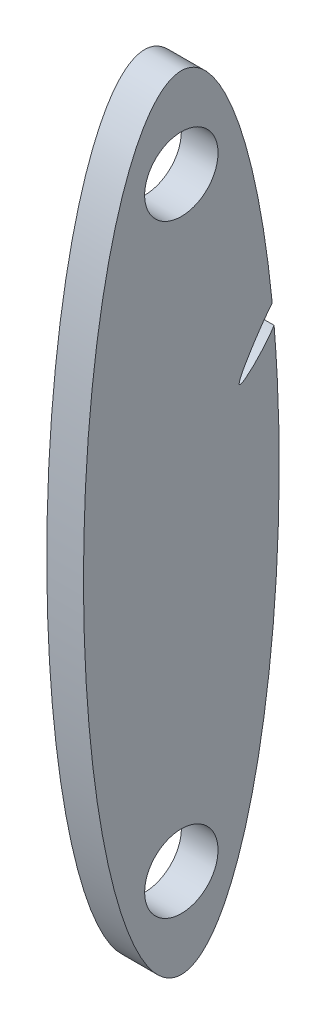
ISO-10303-21;
HEADER;
FILE_DESCRIPTION(('STEP AP214'),'2;1');
FILE_NAME('part.step','',(''),(''),'','','');
FILE_SCHEMA(('AUTOMOTIVE_DESIGN { 1 0 10303 214 1 1 1 1 }'));
ENDSEC;
DATA;
#1=APPLICATION_CONTEXT('core data for automotive mechanical design processes');
#2=APPLICATION_PROTOCOL_DEFINITION('international standard','automotive_design',2000,#1);
#3=PRODUCT_CONTEXT('',#1,'mechanical');
#4=PRODUCT('Part','Part','',(#3));
#5=PRODUCT_RELATED_PRODUCT_CATEGORY('part','',(#4));
#6=PRODUCT_DEFINITION_FORMATION('','',#4);
#7=PRODUCT_DEFINITION_CONTEXT('part definition',#1,'design');
#8=PRODUCT_DEFINITION('design','',#6,#7);
#9=PRODUCT_DEFINITION_SHAPE('','',#8);
#10=(LENGTH_UNIT() NAMED_UNIT(*) SI_UNIT(.MILLI.,.METRE.));
#11=(NAMED_UNIT(*) PLANE_ANGLE_UNIT() SI_UNIT($,.RADIAN.));
#12=(NAMED_UNIT(*) SI_UNIT($,.STERADIAN.) SOLID_ANGLE_UNIT());
#13=UNCERTAINTY_MEASURE_WITH_UNIT(LENGTH_MEASURE(1.E-05),#10,'distance_accuracy_value','');
#14=(GEOMETRIC_REPRESENTATION_CONTEXT(3) GLOBAL_UNCERTAINTY_ASSIGNED_CONTEXT((#13)) GLOBAL_UNIT_ASSIGNED_CONTEXT((#10,
#11,#12)) REPRESENTATION_CONTEXT('',''));
#15=CARTESIAN_POINT('',(0.,0.,0.));
#16=DIRECTION('',(0.,0.,1.));
#17=DIRECTION('',(1.,0.,0.));
#18=AXIS2_PLACEMENT_3D('',#15,#16,#17);
#19=CARTESIAN_POINT('',(-33.4763085519601,11.0049254743421,12.7015141607553));
#20=DIRECTION('',(1.,0.,0.));
#21=DIRECTION('',(0.,1.,0.));
#22=AXIS2_PLACEMENT_3D('',#19,#20,#21);
#23=ELLIPSE('',#22,50.8,12.7);
#24=DIRECTION('',(-1.,0.,0.));
#25=VECTOR('',#24,1.);
#26=SURFACE_OF_LINEAR_EXTRUSION('',#23,#25);
#27=CARTESIAN_POINT('',(-38.2388085519601,11.0049254743421,12.7015141607553));
#28=DIRECTION('',(1.,0.,0.));
#29=DIRECTION('',(0.,1.,0.));
#30=AXIS2_PLACEMENT_3D('',#27,#28,#29);
#31=ELLIPSE('',#30,50.8,12.7);
#32=CARTESIAN_POINT('',(-38.2388085519601,29.8165764931943,0.904369946093564));
#33=VERTEX_POINT('',#32);
#34=CARTESIAN_POINT('',(-38.2388085519601,27.1654187722281,0.661273153073566));
#35=VERTEX_POINT('',#34);
#36=EDGE_CURVE('E47',#33,#35,#31,.T.);
#37=ORIENTED_EDGE('',*,*,#36,.T.);
#38=DIRECTION('',(-1.,0.,0.));
#39=VECTOR('',#38,1.);
#40=CARTESIAN_POINT('',(-33.4763085519601,27.1654187722282,0.661273153073573));
#41=LINE('',#40,#39);
#42=CARTESIAN_POINT('',(-33.4763085519601,27.1654187722281,0.661273153073604));
#43=VERTEX_POINT('',#42);
#44=EDGE_CURVE('E61',#35,#43,#41,.F.);
#45=ORIENTED_EDGE('',*,*,#44,.T.);
#46=CARTESIAN_POINT('',(-33.4763085519601,29.8165764931943,0.904369946093564));
#47=VERTEX_POINT('',#46);
#48=EDGE_CURVE('E82',#47,#43,#23,.T.);
#49=ORIENTED_EDGE('',*,*,#48,.F.);
#50=DIRECTION('',(-1.,0.,0.));
#51=VECTOR('',#50,1.);
#52=CARTESIAN_POINT('',(-33.4763085519601,29.8165764931956,0.90436994609243));
#53=LINE('',#52,#51);
#54=EDGE_CURVE('E68',#47,#33,#53,.T.);
#55=ORIENTED_EDGE('',*,*,#54,.T.);
#56=EDGE_LOOP('',(#37,#45,#49,#55));
#57=FACE_BOUND('',#56,.T.);
#58=ADVANCED_FACE('F42',(#57),#26,.F.);
#59=CARTESIAN_POINT('',(-33.4763085519601,11.0049254743421,12.7015141607553));
#60=DIRECTION('',(1.,0.,0.));
#61=DIRECTION('',(0.,0.,-1.));
#62=AXIS2_PLACEMENT_3D('',#59,#60,#61);
#63=PLANE('',#62);
#64=CARTESIAN_POINT('',(-33.4763085519601,28.3167330338183,0.761713809033404));
#65=CARTESIAN_POINT('',(-33.4763085519601,28.3073109288776,0.766084061675432));
#66=CARTESIAN_POINT('',(-33.4763085519601,28.2127577921962,0.809987500672548));
#67=CARTESIAN_POINT('',(-33.4763085519601,28.5682179118037,-1.41979753605879));
#68=CARTESIAN_POINT('',(-33.4763085519601,14.109205155338,12.2345722030715));
#69=CARTESIAN_POINT('',(-33.4763085519601,35.1329697499063,-2.39985960843786));
#70=CARTESIAN_POINT('',(-33.4763085519601,28.3167330338183,0.761713809033404));
#71=B_SPLINE_CURVE_WITH_KNOTS('',3,(#64,#65,#66,#67,#68,#69,#70),.UNSPECIFIED.,.T.,.F.,(4,1,1,1,
4),(0.,0.000689761191466576,0.00689761191466631,0.501005816832603,0.999999999999999),.UNSPECIFIED.);
#72=EDGE_CURVE('E70',#43,#47,#71,.T.);
#73=ORIENTED_EDGE('',*,*,#72,.T.);
#74=ORIENTED_EDGE('',*,*,#48,.T.);
#75=EDGE_LOOP('',(#73,#74));
#76=FACE_BOUND('',#75,.T.);
#77=CARTESIAN_POINT('',(-33.4763085519601,-28.1714503256579,12.7015141607553));
#78=DIRECTION('',(1.,0.,0.));
#79=DIRECTION('',(0.,0.,-1.));
#80=AXIS2_PLACEMENT_3D('',#77,#78,#79);
#81=CIRCLE('',#80,4.7625);
#82=CARTESIAN_POINT('',(-33.4763085519601,-28.1714503256579,17.4640141607553));
#83=VERTEX_POINT('',#82);
#84=EDGE_CURVE('E11',#83,#83,#81,.T.);
#85=ORIENTED_EDGE('',*,*,#84,.F.);
#86=EDGE_LOOP('',(#85));
#87=FACE_BOUND('',#86,.T.);
#88=CARTESIAN_POINT('',(-33.4763085519601,50.1813048832803,12.7015141607553));
#89=DIRECTION('',(1.,0.,0.));
#90=DIRECTION('',(0.,0.,-1.));
#91=AXIS2_PLACEMENT_3D('',#88,#89,#90);
#92=CIRCLE('',#91,4.7625);
#93=CARTESIAN_POINT('',(-33.4763085519601,50.1813048832803,7.93901416075532));
#94=VERTEX_POINT('',#93);
#95=EDGE_CURVE('E53',#94,#94,#92,.T.);
#96=ORIENTED_EDGE('',*,*,#95,.F.);
#97=EDGE_LOOP('',(#96));
#98=FACE_BOUND('',#97,.T.);
#99=ADVANCED_FACE('F80',(#76,#87,#98),#63,.T.);
#100=CARTESIAN_POINT('',(-38.2388085519601,11.0049254743421,12.7015141607553));
#101=DIRECTION('',(1.,0.,0.));
#102=DIRECTION('',(0.,0.,-1.));
#103=AXIS2_PLACEMENT_3D('',#100,#101,#102);
#104=PLANE('',#103);
#105=CARTESIAN_POINT('',(-38.2388085519601,50.1813048832803,12.7015141607553));
#106=DIRECTION('',(1.,0.,0.));
#107=DIRECTION('',(0.,0.,-1.));
#108=AXIS2_PLACEMENT_3D('',#105,#106,#107);
#109=CIRCLE('',#108,4.7625);
#110=CARTESIAN_POINT('',(-38.2388085519601,50.1813048832803,7.93901416075532));
#111=VERTEX_POINT('',#110);
#112=EDGE_CURVE('E85',#111,#111,#109,.T.);
#113=ORIENTED_EDGE('',*,*,#112,.T.);
#114=EDGE_LOOP('',(#113));
#115=FACE_BOUND('',#114,.T.);
#116=CARTESIAN_POINT('',(-38.2388085519601,-28.1714503256579,12.7015141607553));
#117=DIRECTION('',(1.,0.,0.));
#118=DIRECTION('',(0.,0.,-1.));
#119=AXIS2_PLACEMENT_3D('',#116,#117,#118);
#120=CIRCLE('',#119,4.7625);
#121=CARTESIAN_POINT('',(-38.2388085519601,-28.1714503256579,17.4640141607553));
#122=VERTEX_POINT('',#121);
#123=EDGE_CURVE('E89',#122,#122,#120,.T.);
#124=ORIENTED_EDGE('',*,*,#123,.T.);
#125=EDGE_LOOP('',(#124));
#126=FACE_BOUND('',#125,.T.);
#127=ORIENTED_EDGE('',*,*,#36,.F.);
#128=CARTESIAN_POINT('',(-38.2388085519601,28.3167330338183,0.761713809033404));
#129=CARTESIAN_POINT('',(-38.2388085519601,28.3073109288776,0.766084061675432));
#130=CARTESIAN_POINT('',(-38.2388085519601,28.2127577921962,0.809987500672548));
#131=CARTESIAN_POINT('',(-38.2388085519601,28.5682179118037,-1.41979753605879));
#132=CARTESIAN_POINT('',(-38.2388085519601,14.109205155338,12.2345722030715));
#133=CARTESIAN_POINT('',(-38.2388085519601,35.1329697499063,-2.39985960843786));
#134=CARTESIAN_POINT('',(-38.2388085519601,28.3167330338183,0.761713809033404));
#135=B_SPLINE_CURVE_WITH_KNOTS('',3,(#128,#129,#130,#131,#132,#133,#134),.UNSPECIFIED.,.T.,.F.,
(4,1,1,1,4),(0.,0.000689761191466576,0.00689761191466631,0.501005816832603,0.999999999999999),.UNSPECIFIED.);
#136=EDGE_CURVE('E71',#33,#35,#135,.F.);
#137=ORIENTED_EDGE('',*,*,#136,.T.);
#138=EDGE_LOOP('',(#127,#137));
#139=FACE_BOUND('',#138,.T.);
#140=ADVANCED_FACE('F100',(#115,#126,#139),#104,.F.);
#141=CARTESIAN_POINT('',(-38.2388085519601,50.1813048832803,12.7015141607553));
#142=DIRECTION('',(1.,0.,0.));
#143=DIRECTION('',(0.,0.,-1.));
#144=AXIS2_PLACEMENT_3D('',#141,#142,#143);
#145=CYLINDRICAL_SURFACE('',#144,4.7625);
#146=CARTESIAN_POINT('',(-38.2388085519601,50.1813048832803,7.93901416075532));
#147=CARTESIAN_POINT('',(-38.1891991769601,50.1813048832803,7.93901416075532));
#148=CARTESIAN_POINT('',(-38.1395898019601,50.1813048832803,7.93901416075532));
#149=CARTESIAN_POINT('',(-38.0403710519601,50.1813048832803,7.93901416075532));
#150=CARTESIAN_POINT('',(-37.9907616769601,50.1813048832803,7.93901416075532));
#151=CARTESIAN_POINT('',(-37.8915429269601,50.1813048832803,7.93901416075532));
#152=CARTESIAN_POINT('',(-37.8419335519601,50.1813048832803,7.93901416075532));
#153=CARTESIAN_POINT('',(-37.7427148019601,50.1813048832803,7.93901416075532));
#154=CARTESIAN_POINT('',(-37.6931054269601,50.1813048832803,7.93901416075532));
#155=CARTESIAN_POINT('',(-37.5938866769601,50.1813048832803,7.93901416075532));
#156=CARTESIAN_POINT('',(-37.5442773019601,50.1813048832803,7.93901416075532));
#157=CARTESIAN_POINT('',(-37.4450585519601,50.1813048832803,7.93901416075532));
#158=CARTESIAN_POINT('',(-37.3954491769601,50.1813048832803,7.93901416075532));
#159=CARTESIAN_POINT('',(-37.2962304269601,50.1813048832803,7.93901416075532));
#160=CARTESIAN_POINT('',(-37.2466210519601,50.1813048832803,7.93901416075532));
#161=CARTESIAN_POINT('',(-37.1474023019601,50.1813048832803,7.93901416075532));
#162=CARTESIAN_POINT('',(-37.0977929269601,50.1813048832803,7.93901416075532));
#163=CARTESIAN_POINT('',(-36.9985741769601,50.1813048832803,7.93901416075532));
#164=CARTESIAN_POINT('',(-36.9489648019601,50.1813048832803,7.93901416075532));
#165=CARTESIAN_POINT('',(-36.8497460519601,50.1813048832803,7.93901416075532));
#166=CARTESIAN_POINT('',(-36.8001366769601,50.1813048832803,7.93901416075532));
#167=CARTESIAN_POINT('',(-36.7009179269601,50.1813048832803,7.93901416075532));
#168=CARTESIAN_POINT('',(-36.6513085519601,50.1813048832803,7.93901416075532));
#169=CARTESIAN_POINT('',(-36.5520898019601,50.1813048832803,7.93901416075532));
#170=CARTESIAN_POINT('',(-36.5024804269601,50.1813048832803,7.93901416075532));
#171=CARTESIAN_POINT('',(-36.4032616769601,50.1813048832803,7.93901416075532));
#172=CARTESIAN_POINT('',(-36.3536523019601,50.1813048832803,7.93901416075532));
#173=CARTESIAN_POINT('',(-36.2544335519601,50.1813048832803,7.93901416075532));
#174=CARTESIAN_POINT('',(-36.2048241769601,50.1813048832803,7.93901416075532));
#175=CARTESIAN_POINT('',(-36.1056054269601,50.1813048832803,7.93901416075532));
#176=CARTESIAN_POINT('',(-36.0559960519601,50.1813048832803,7.93901416075532));
#177=CARTESIAN_POINT('',(-35.9567773019601,50.1813048832803,7.93901416075532));
#178=CARTESIAN_POINT('',(-35.9071679269601,50.1813048832803,7.93901416075532));
#179=CARTESIAN_POINT('',(-35.8079491769601,50.1813048832803,7.93901416075532));
#180=CARTESIAN_POINT('',(-35.7583398019601,50.1813048832803,7.93901416075532));
#181=CARTESIAN_POINT('',(-35.6591210519601,50.1813048832803,7.93901416075532));
#182=CARTESIAN_POINT('',(-35.6095116769601,50.1813048832803,7.93901416075532));
#183=CARTESIAN_POINT('',(-35.5102929269601,50.1813048832803,7.93901416075532));
#184=CARTESIAN_POINT('',(-35.4606835519601,50.1813048832803,7.93901416075532));
#185=CARTESIAN_POINT('',(-35.3614648019601,50.1813048832803,7.93901416075532));
#186=CARTESIAN_POINT('',(-35.3118554269601,50.1813048832803,7.93901416075532));
#187=CARTESIAN_POINT('',(-35.2126366769601,50.1813048832803,7.93901416075532));
#188=CARTESIAN_POINT('',(-35.1630273019601,50.1813048832803,7.93901416075532));
#189=CARTESIAN_POINT('',(-35.0638085519601,50.1813048832803,7.93901416075532));
#190=CARTESIAN_POINT('',(-35.0141991769601,50.1813048832803,7.93901416075532));
#191=CARTESIAN_POINT('',(-34.9149804269601,50.1813048832803,7.93901416075532));
#192=CARTESIAN_POINT('',(-34.8653710519601,50.1813048832803,7.93901416075532));
#193=CARTESIAN_POINT('',(-34.7661523019601,50.1813048832803,7.93901416075532));
#194=CARTESIAN_POINT('',(-34.7165429269601,50.1813048832803,7.93901416075532));
#195=CARTESIAN_POINT('',(-34.6173241769601,50.1813048832803,7.93901416075532));
#196=CARTESIAN_POINT('',(-34.5677148019601,50.1813048832803,7.93901416075532));
#197=CARTESIAN_POINT('',(-34.4684960519601,50.1813048832803,7.93901416075532));
#198=CARTESIAN_POINT('',(-34.4188866769601,50.1813048832803,7.93901416075532));
#199=CARTESIAN_POINT('',(-34.3196679269601,50.1813048832803,7.93901416075532));
#200=CARTESIAN_POINT('',(-34.2700585519601,50.1813048832803,7.93901416075532));
#201=CARTESIAN_POINT('',(-34.1708398019601,50.1813048832803,7.93901416075532));
#202=CARTESIAN_POINT('',(-34.1212304269601,50.1813048832803,7.93901416075532));
#203=CARTESIAN_POINT('',(-34.0220116769601,50.1813048832803,7.93901416075532));
#204=CARTESIAN_POINT('',(-33.9724023019601,50.1813048832803,7.93901416075532));
#205=CARTESIAN_POINT('',(-33.8731835519601,50.1813048832803,7.93901416075532));
#206=CARTESIAN_POINT('',(-33.8235741769601,50.1813048832803,7.93901416075532));
#207=CARTESIAN_POINT('',(-33.7243554269601,50.1813048832803,7.93901416075532));
#208=CARTESIAN_POINT('',(-33.6747460519601,50.1813048832803,7.93901416075532));
#209=CARTESIAN_POINT('',(-33.5755273019601,50.1813048832803,7.93901416075532));
#210=CARTESIAN_POINT('',(-33.5259179269601,50.1813048832803,7.93901416075532));
#211=CARTESIAN_POINT('',(-33.4763085519601,50.1813048832803,7.93901416075532));
#212=B_SPLINE_CURVE_WITH_KNOTS('',3,(#146,#147,#148,#149,#150,#151,#152,#153,#154,#155,#156,
#157,#158,#159,#160,#161,#162,#163,#164,#165,#166,#167,#168,#169,#170,#171,#172,#173,#174,#175,
#176,#177,#178,#179,#180,#181,#182,#183,#184,#185,#186,#187,#188,#189,#190,#191,#192,#193,#194,
#195,#196,#197,#198,#199,#200,#201,#202,#203,#204,#205,#206,#207,#208,#209,#210,#211),
.UNSPECIFIED.,.F.,.F.,(4,2,2,2,2,2,2,2,2,2,2,2,2,2,2,2,2,2,2,2,2,2,2,2,2,2,2,2,2,2,2,2,4),(0.,
0.148828124999993,0.297656249999993,0.446484374999993,0.595312499999993,0.744140624999994,
0.892968749999994,1.04179687499999,1.19062499999999,1.33945312499999,1.48828124999999,
1.63710937499999,1.78593749999999,1.93476562499999,2.08359374999999,2.23242187499999,
2.38124999999999,2.53007812499999,2.67890624999999,2.82773437499999,2.97656249999999,
3.12539062499999,3.27421874999999,3.42304687499999,3.571875,3.720703125,3.86953125,4.018359375,
4.1671875,4.316015625,4.46484375,4.613671875,4.7625),.UNSPECIFIED.);
#213=EDGE_CURVE('BSEAM103',#111,#94,#212,.T.);
#214=ORIENTED_EDGE('',*,*,#112,.F.);
#215=ORIENTED_EDGE('',*,*,#95,.T.);
#216=ORIENTED_EDGE('',*,*,#213,.T.);
#217=ORIENTED_EDGE('',*,*,#213,.F.);
#218=EDGE_LOOP('',(#214,#216,#215,#217));
#219=FACE_BOUND('',#218,.T.);
#220=ADVANCED_FACE('F103',(#219),#145,.F.);
#221=CARTESIAN_POINT('',(-33.4763085519601,-28.1714503256579,12.7015141607553));
#222=DIRECTION('',(-1.,0.,0.));
#223=DIRECTION('',(0.,0.,1.));
#224=AXIS2_PLACEMENT_3D('',#221,#222,#223);
#225=CYLINDRICAL_SURFACE('',#224,4.7625);
#226=CARTESIAN_POINT('',(-33.4763085519601,-28.1714503256579,17.4640141607553));
#227=CARTESIAN_POINT('',(-33.5259179269601,-28.1714503256579,17.4640141607553));
#228=CARTESIAN_POINT('',(-33.5755273019601,-28.1714503256579,17.4640141607553));
#229=CARTESIAN_POINT('',(-33.6747460519601,-28.1714503256579,17.4640141607553));
#230=CARTESIAN_POINT('',(-33.7243554269601,-28.1714503256579,17.4640141607553));
#231=CARTESIAN_POINT('',(-33.8235741769601,-28.1714503256579,17.4640141607553));
#232=CARTESIAN_POINT('',(-33.8731835519601,-28.1714503256579,17.4640141607553));
#233=CARTESIAN_POINT('',(-33.9724023019601,-28.1714503256579,17.4640141607553));
#234=CARTESIAN_POINT('',(-34.0220116769601,-28.1714503256579,17.4640141607553));
#235=CARTESIAN_POINT('',(-34.1212304269601,-28.1714503256579,17.4640141607553));
#236=CARTESIAN_POINT('',(-34.1708398019601,-28.1714503256579,17.4640141607553));
#237=CARTESIAN_POINT('',(-34.2700585519601,-28.1714503256579,17.4640141607553));
#238=CARTESIAN_POINT('',(-34.3196679269601,-28.1714503256579,17.4640141607553));
#239=CARTESIAN_POINT('',(-34.4188866769601,-28.1714503256579,17.4640141607553));
#240=CARTESIAN_POINT('',(-34.4684960519601,-28.1714503256579,17.4640141607553));
#241=CARTESIAN_POINT('',(-34.5677148019601,-28.1714503256579,17.4640141607553));
#242=CARTESIAN_POINT('',(-34.6173241769601,-28.1714503256579,17.4640141607553));
#243=CARTESIAN_POINT('',(-34.7165429269601,-28.1714503256579,17.4640141607553));
#244=CARTESIAN_POINT('',(-34.7661523019601,-28.1714503256579,17.4640141607553));
#245=CARTESIAN_POINT('',(-34.8653710519601,-28.1714503256579,17.4640141607553));
#246=CARTESIAN_POINT('',(-34.9149804269601,-28.1714503256579,17.4640141607553));
#247=CARTESIAN_POINT('',(-35.0141991769601,-28.1714503256579,17.4640141607553));
#248=CARTESIAN_POINT('',(-35.0638085519601,-28.1714503256579,17.4640141607553));
#249=CARTESIAN_POINT('',(-35.1630273019601,-28.1714503256579,17.4640141607553));
#250=CARTESIAN_POINT('',(-35.2126366769601,-28.1714503256579,17.4640141607553));
#251=CARTESIAN_POINT('',(-35.3118554269601,-28.1714503256579,17.4640141607553));
#252=CARTESIAN_POINT('',(-35.3614648019601,-28.1714503256579,17.4640141607553));
#253=CARTESIAN_POINT('',(-35.4606835519601,-28.1714503256579,17.4640141607553));
#254=CARTESIAN_POINT('',(-35.5102929269601,-28.1714503256579,17.4640141607553));
#255=CARTESIAN_POINT('',(-35.6095116769601,-28.1714503256579,17.4640141607553));
#256=CARTESIAN_POINT('',(-35.6591210519601,-28.1714503256579,17.4640141607553));
#257=CARTESIAN_POINT('',(-35.7583398019601,-28.1714503256579,17.4640141607553));
#258=CARTESIAN_POINT('',(-35.8079491769601,-28.1714503256579,17.4640141607553));
#259=CARTESIAN_POINT('',(-35.9071679269601,-28.1714503256579,17.4640141607553));
#260=CARTESIAN_POINT('',(-35.9567773019601,-28.1714503256579,17.4640141607553));
#261=CARTESIAN_POINT('',(-36.0559960519601,-28.1714503256579,17.4640141607553));
#262=CARTESIAN_POINT('',(-36.1056054269601,-28.1714503256579,17.4640141607553));
#263=CARTESIAN_POINT('',(-36.2048241769601,-28.1714503256579,17.4640141607553));
#264=CARTESIAN_POINT('',(-36.2544335519601,-28.1714503256579,17.4640141607553));
#265=CARTESIAN_POINT('',(-36.3536523019601,-28.1714503256579,17.4640141607553));
#266=CARTESIAN_POINT('',(-36.4032616769601,-28.1714503256579,17.4640141607553));
#267=CARTESIAN_POINT('',(-36.5024804269601,-28.1714503256579,17.4640141607553));
#268=CARTESIAN_POINT('',(-36.5520898019601,-28.1714503256579,17.4640141607553));
#269=CARTESIAN_POINT('',(-36.6513085519601,-28.1714503256579,17.4640141607553));
#270=CARTESIAN_POINT('',(-36.7009179269601,-28.1714503256579,17.4640141607553));
#271=CARTESIAN_POINT('',(-36.8001366769601,-28.1714503256579,17.4640141607553));
#272=CARTESIAN_POINT('',(-36.8497460519601,-28.1714503256579,17.4640141607553));
#273=CARTESIAN_POINT('',(-36.9489648019601,-28.1714503256579,17.4640141607553));
#274=CARTESIAN_POINT('',(-36.9985741769601,-28.1714503256579,17.4640141607553));
#275=CARTESIAN_POINT('',(-37.0977929269601,-28.1714503256579,17.4640141607553));
#276=CARTESIAN_POINT('',(-37.1474023019601,-28.1714503256579,17.4640141607553));
#277=CARTESIAN_POINT('',(-37.2466210519601,-28.1714503256579,17.4640141607553));
#278=CARTESIAN_POINT('',(-37.2962304269601,-28.1714503256579,17.4640141607553));
#279=CARTESIAN_POINT('',(-37.3954491769601,-28.1714503256579,17.4640141607553));
#280=CARTESIAN_POINT('',(-37.4450585519601,-28.1714503256579,17.4640141607553));
#281=CARTESIAN_POINT('',(-37.5442773019601,-28.1714503256579,17.4640141607553));
#282=CARTESIAN_POINT('',(-37.5938866769601,-28.1714503256579,17.4640141607553));
#283=CARTESIAN_POINT('',(-37.6931054269601,-28.1714503256579,17.4640141607553));
#284=CARTESIAN_POINT('',(-37.7427148019601,-28.1714503256579,17.4640141607553));
#285=CARTESIAN_POINT('',(-37.8419335519601,-28.1714503256579,17.4640141607553));
#286=CARTESIAN_POINT('',(-37.8915429269601,-28.1714503256579,17.4640141607553));
#287=CARTESIAN_POINT('',(-37.9907616769601,-28.1714503256579,17.4640141607553));
#288=CARTESIAN_POINT('',(-38.0403710519601,-28.1714503256579,17.4640141607553));
#289=CARTESIAN_POINT('',(-38.1395898019601,-28.1714503256579,17.4640141607553));
#290=CARTESIAN_POINT('',(-38.1891991769601,-28.1714503256579,17.4640141607553));
#291=CARTESIAN_POINT('',(-38.2388085519601,-28.1714503256579,17.4640141607553));
#292=B_SPLINE_CURVE_WITH_KNOTS('',3,(#226,#227,#228,#229,#230,#231,#232,#233,#234,#235,#236,
#237,#238,#239,#240,#241,#242,#243,#244,#245,#246,#247,#248,#249,#250,#251,#252,#253,#254,#255,
#256,#257,#258,#259,#260,#261,#262,#263,#264,#265,#266,#267,#268,#269,#270,#271,#272,#273,#274,
#275,#276,#277,#278,#279,#280,#281,#282,#283,#284,#285,#286,#287,#288,#289,#290,#291),
.UNSPECIFIED.,.F.,.F.,(4,2,2,2,2,2,2,2,2,2,2,2,2,2,2,2,2,2,2,2,2,2,2,2,2,2,2,2,2,2,2,2,4),(0.,
0.148828125000007,0.297656250000007,0.446484375000007,0.595312500000007,0.744140625000007,
0.892968750000007,1.04179687500001,1.19062500000001,1.33945312500001,1.48828125000001,
1.63710937500001,1.78593750000001,1.93476562500001,2.08359375000001,2.23242187500001,
2.38125000000001,2.53007812500001,2.67890625000001,2.82773437500001,2.97656250000001,
3.12539062500001,3.27421875000001,3.42304687500001,3.57187500000001,3.72070312500001,
3.86953125000001,4.01835937500001,4.16718750000001,4.31601562500001,4.46484375000001,
4.61367187500001,4.76250000000001),.UNSPECIFIED.);
#293=EDGE_CURVE('BSEAM105',#83,#122,#292,.T.);
#294=ORIENTED_EDGE('',*,*,#84,.T.);
#295=ORIENTED_EDGE('',*,*,#123,.F.);
#296=ORIENTED_EDGE('',*,*,#293,.T.);
#297=ORIENTED_EDGE('',*,*,#293,.F.);
#298=EDGE_LOOP('',(#294,#296,#295,#297));
#299=FACE_BOUND('',#298,.T.);
#300=ADVANCED_FACE('F105',(#299),#225,.F.);
#301=DIRECTION('',(-1.,0.,0.));
#302=VECTOR('',#301,1.);
#303=SURFACE_OF_LINEAR_EXTRUSION('',#71,#302);
#304=ORIENTED_EDGE('',*,*,#136,.F.);
#305=ORIENTED_EDGE('',*,*,#54,.F.);
#306=ORIENTED_EDGE('',*,*,#72,.F.);
#307=ORIENTED_EDGE('',*,*,#44,.F.);
#308=EDGE_LOOP('',(#304,#305,#306,#307));
#309=FACE_BOUND('',#308,.T.);
#310=ADVANCED_FACE('F44',(#309),#303,.F.);
#311=CLOSED_SHELL('',(#58,#99,#140,#220,#300,#310));
#312=MANIFOLD_SOLID_BREP('B2',#311);
#313=ADVANCED_BREP_SHAPE_REPRESENTATION('',(#18,#312),#14);
#314=SHAPE_DEFINITION_REPRESENTATION(#9,#313);
ENDSEC;
END-ISO-10303-21;
